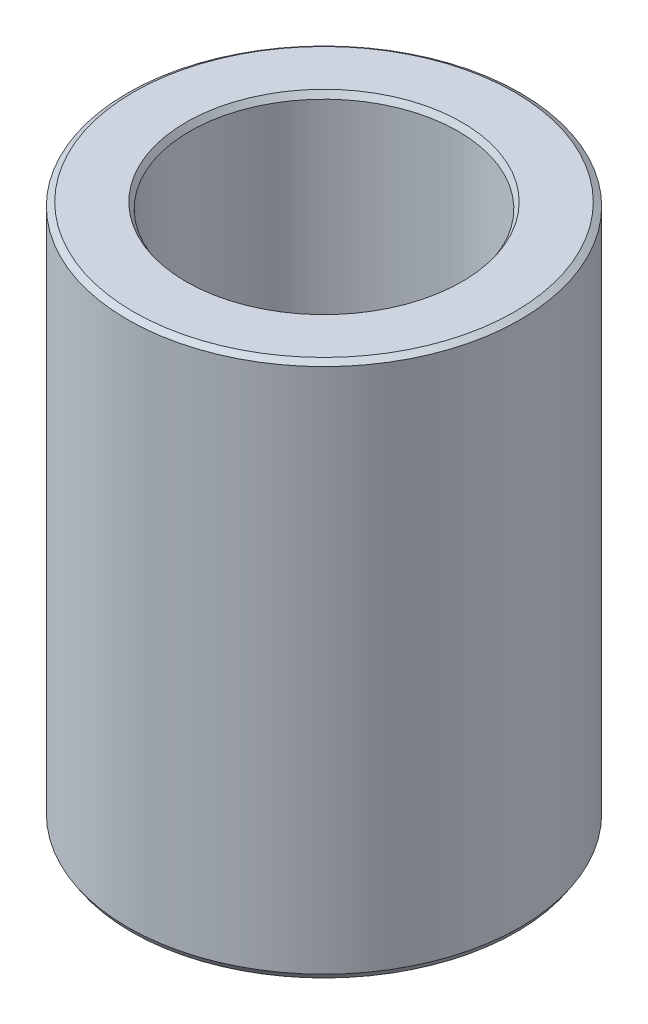
ISO-10303-21;
HEADER;
FILE_DESCRIPTION(('STEP AP214'),'2;1');
FILE_NAME('part.step','',(''),(''),'','','');
FILE_SCHEMA(('AUTOMOTIVE_DESIGN { 1 0 10303 214 1 1 1 1 }'));
ENDSEC;
DATA;
#1=APPLICATION_CONTEXT('core data for automotive mechanical design processes');
#2=APPLICATION_PROTOCOL_DEFINITION('international standard','automotive_design',2000,#1);
#3=PRODUCT_CONTEXT('',#1,'mechanical');
#4=PRODUCT('Part','Part','',(#3));
#5=PRODUCT_RELATED_PRODUCT_CATEGORY('part','',(#4));
#6=PRODUCT_DEFINITION_FORMATION('','',#4);
#7=PRODUCT_DEFINITION_CONTEXT('part definition',#1,'design');
#8=PRODUCT_DEFINITION('design','',#6,#7);
#9=PRODUCT_DEFINITION_SHAPE('','',#8);
#10=(LENGTH_UNIT() NAMED_UNIT(*) SI_UNIT(.MILLI.,.METRE.));
#11=(NAMED_UNIT(*) PLANE_ANGLE_UNIT() SI_UNIT($,.RADIAN.));
#12=(NAMED_UNIT(*) SI_UNIT($,.STERADIAN.) SOLID_ANGLE_UNIT());
#13=UNCERTAINTY_MEASURE_WITH_UNIT(LENGTH_MEASURE(1.E-05),#10,'distance_accuracy_value','');
#14=(GEOMETRIC_REPRESENTATION_CONTEXT(3) GLOBAL_UNCERTAINTY_ASSIGNED_CONTEXT((#13)) GLOBAL_UNIT_ASSIGNED_CONTEXT((#10,
#11,#12)) REPRESENTATION_CONTEXT('',''));
#15=CARTESIAN_POINT('',(0.,0.,0.));
#16=DIRECTION('',(0.,0.,1.));
#17=DIRECTION('',(1.,0.,0.));
#18=AXIS2_PLACEMENT_3D('',#15,#16,#17);
#19=CARTESIAN_POINT('',(0.,61.4130107186941,0.));
#20=DIRECTION('',(0.,-1.,0.));
#21=DIRECTION('',(0.,0.,-1.));
#22=AXIS2_PLACEMENT_3D('',#19,#20,#21);
#23=CYLINDRICAL_SURFACE('',#22,22.5);
#24=CARTESIAN_POINT('',(0.,0.6778723919579,0.));
#25=DIRECTION('',(0.,1.,0.));
#26=DIRECTION('',(0.,0.,1.));
#27=AXIS2_PLACEMENT_3D('',#24,#25,#26);
#28=CIRCLE('',#27,22.5);
#29=CARTESIAN_POINT('',(0.,0.6778723919579,-22.5));
#30=VERTEX_POINT('',#29);
#31=EDGE_CURVE('E10',#30,#30,#28,.T.);
#32=CARTESIAN_POINT('',(0.,60.981662881879,0.));
#33=DIRECTION('',(0.,1.,0.));
#34=DIRECTION('',(0.,0.,1.));
#35=AXIS2_PLACEMENT_3D('',#32,#33,#34);
#36=CIRCLE('',#35,22.5);
#37=CARTESIAN_POINT('',(0.,60.981662881879,-22.5));
#38=VERTEX_POINT('',#37);
#39=EDGE_CURVE('E50',#38,#38,#36,.F.);
#40=CARTESIAN_POINT('',(0.,0.6778723919579,-22.5));
#41=CARTESIAN_POINT('',(0.,1.30603687622791,-22.5));
#42=CARTESIAN_POINT('',(0.,1.93420136049792,-22.5));
#43=CARTESIAN_POINT('',(0.,3.19053032903794,-22.5));
#44=CARTESIAN_POINT('',(0.,3.81869481330796,-22.5));
#45=CARTESIAN_POINT('',(0.,5.07502378184798,-22.5));
#46=CARTESIAN_POINT('',(0.,5.70318826611799,-22.5));
#47=CARTESIAN_POINT('',(0.,6.95951723465802,-22.5));
#48=CARTESIAN_POINT('',(0.,7.58768171892803,-22.5));
#49=CARTESIAN_POINT('',(0.,8.84401068746805,-22.5));
#50=CARTESIAN_POINT('',(0.,9.47217517173806,-22.5));
#51=CARTESIAN_POINT('',(0.,10.7285041402781,-22.5));
#52=CARTESIAN_POINT('',(0.,11.3566686245481,-22.5));
#53=CARTESIAN_POINT('',(0.,12.6129975930881,-22.5));
#54=CARTESIAN_POINT('',(0.,13.2411620773581,-22.5));
#55=CARTESIAN_POINT('',(0.,14.4974910458982,-22.5));
#56=CARTESIAN_POINT('',(0.,15.1256555301682,-22.5));
#57=CARTESIAN_POINT('',(0.,16.3819844987082,-22.5));
#58=CARTESIAN_POINT('',(0.,17.0101489829782,-22.5));
#59=CARTESIAN_POINT('',(0.,18.2664779515182,-22.5));
#60=CARTESIAN_POINT('',(0.,18.8946424357882,-22.5));
#61=CARTESIAN_POINT('',(0.,20.1509714043283,-22.5));
#62=CARTESIAN_POINT('',(0.,20.7791358885983,-22.5));
#63=CARTESIAN_POINT('',(0.,22.0354648571383,-22.5));
#64=CARTESIAN_POINT('',(0.,22.6636293414083,-22.5));
#65=CARTESIAN_POINT('',(0.,23.9199583099483,-22.5));
#66=CARTESIAN_POINT('',(0.,24.5481227942183,-22.5));
#67=CARTESIAN_POINT('',(0.,25.8044517627584,-22.5));
#68=CARTESIAN_POINT('',(0.,26.4326162470284,-22.5));
#69=CARTESIAN_POINT('',(0.,27.6889452155684,-22.5));
#70=CARTESIAN_POINT('',(0.,28.3171096998384,-22.5));
#71=CARTESIAN_POINT('',(0.,29.5734386683784,-22.5));
#72=CARTESIAN_POINT('',(0.,30.2016031526484,-22.5));
#73=CARTESIAN_POINT('',(0.,31.4579321211885,-22.5));
#74=CARTESIAN_POINT('',(0.,32.0860966054585,-22.5));
#75=CARTESIAN_POINT('',(0.,33.3424255739985,-22.5));
#76=CARTESIAN_POINT('',(0.,33.9705900582685,-22.5));
#77=CARTESIAN_POINT('',(0.,35.2269190268085,-22.5));
#78=CARTESIAN_POINT('',(0.,35.8550835110785,-22.5));
#79=CARTESIAN_POINT('',(0.,37.1114124796186,-22.5));
#80=CARTESIAN_POINT('',(0.,37.7395769638886,-22.5));
#81=CARTESIAN_POINT('',(0.,38.9959059324286,-22.5));
#82=CARTESIAN_POINT('',(0.,39.6240704166986,-22.5));
#83=CARTESIAN_POINT('',(0.,40.8803993852386,-22.5));
#84=CARTESIAN_POINT('',(0.,41.5085638695087,-22.5));
#85=CARTESIAN_POINT('',(0.,42.7648928380487,-22.5));
#86=CARTESIAN_POINT('',(0.,43.3930573223187,-22.5));
#87=CARTESIAN_POINT('',(0.,44.6493862908587,-22.5));
#88=CARTESIAN_POINT('',(0.,45.2775507751287,-22.5));
#89=CARTESIAN_POINT('',(0.,46.5338797436687,-22.5));
#90=CARTESIAN_POINT('',(0.,47.1620442279388,-22.5));
#91=CARTESIAN_POINT('',(0.,48.4183731964788,-22.5));
#92=CARTESIAN_POINT('',(0.,49.0465376807488,-22.5));
#93=CARTESIAN_POINT('',(0.,50.3028666492888,-22.5));
#94=CARTESIAN_POINT('',(0.,50.9310311335588,-22.5));
#95=CARTESIAN_POINT('',(0.,52.1873601020989,-22.5));
#96=CARTESIAN_POINT('',(0.,52.8155245863689,-22.5));
#97=CARTESIAN_POINT('',(0.,54.0718535549089,-22.5));
#98=CARTESIAN_POINT('',(0.,54.7000180391789,-22.5));
#99=CARTESIAN_POINT('',(0.,55.9563470077189,-22.5));
#100=CARTESIAN_POINT('',(0.,56.5845114919889,-22.5));
#101=CARTESIAN_POINT('',(0.,57.840840460529,-22.5));
#102=CARTESIAN_POINT('',(0.,58.469004944799,-22.5));
#103=CARTESIAN_POINT('',(0.,59.725333913339,-22.5));
#104=CARTESIAN_POINT('',(0.,60.353498397609,-22.5));
#105=CARTESIAN_POINT('',(0.,60.981662881879,-22.5));
#106=B_SPLINE_CURVE_WITH_KNOTS('',3,(#40,#41,#42,#43,#44,#45,#46,#47,#48,#49,#50,#51,#52,#53,
#54,#55,#56,#57,#58,#59,#60,#61,#62,#63,#64,#65,#66,#67,#68,#69,#70,#71,#72,#73,#74,#75,#76,#77,
#78,#79,#80,#81,#82,#83,#84,#85,#86,#87,#88,#89,#90,#91,#92,#93,#94,#95,#96,#97,#98,#99,#100,
#101,#102,#103,#104,#105),.UNSPECIFIED.,.F.,.F.,(4,2,2,2,2,2,2,2,2,2,2,2,2,2,2,2,2,2,2,2,2,2,2,
2,2,2,2,2,2,2,2,2,4),(0.,1.88449345281003,3.76898690562007,5.65348035843011,7.53797381124014,
9.42246726405017,11.3069607168602,13.1914541696702,15.0759476224803,16.9604410752903,
18.8449345281003,20.7294279809104,22.6139214337204,24.4984148865305,26.3829083393405,
28.2674017921505,30.1518952449606,32.0363886977706,33.9208821505806,35.8053756033907,
37.6898690562007,39.5743625090107,41.4588559618208,43.3433494146308,45.2278428674408,
47.1123363202509,48.9968297730609,50.8813232258709,52.765816678681,54.650310131491,
56.534803584301,58.4192970371111,60.3037904899211),.UNSPECIFIED.);
#107=EDGE_CURVE('BSEAM39',#30,#38,#106,.T.);
#108=ORIENTED_EDGE('',*,*,#31,.T.);
#109=ORIENTED_EDGE('',*,*,#39,.T.);
#110=ORIENTED_EDGE('',*,*,#107,.T.);
#111=ORIENTED_EDGE('',*,*,#107,.F.);
#112=EDGE_LOOP('',(#108,#110,#109,#111));
#113=FACE_BOUND('',#112,.T.);
#114=ADVANCED_FACE('F39',(#113),#23,.T.);
#115=CARTESIAN_POINT('',(0.,61.4130107186941,0.));
#116=DIRECTION('',(0.,1.,0.));
#117=DIRECTION('',(0.,0.,1.));
#118=AXIS2_PLACEMENT_3D('',#115,#116,#117);
#119=PLANE('',#118);
#120=CARTESIAN_POINT('',(0.,61.4130107186941,0.));
#121=DIRECTION('',(0.,1.,0.));
#122=DIRECTION('',(0.,0.,1.));
#123=AXIS2_PLACEMENT_3D('',#120,#121,#122);
#124=CIRCLE('',#123,15.8183387595568);
#125=CARTESIAN_POINT('',(0.,61.4130107186941,15.8183387595568));
#126=VERTEX_POINT('',#125);
#127=EDGE_CURVE('E58',#126,#126,#124,.F.);
#128=ORIENTED_EDGE('',*,*,#127,.T.);
#129=EDGE_LOOP('',(#128));
#130=FACE_BOUND('',#129,.T.);
#131=CARTESIAN_POINT('',(0.,61.4130107186941,0.));
#132=DIRECTION('',(0.,1.,0.));
#133=DIRECTION('',(0.,0.,1.));
#134=AXIS2_PLACEMENT_3D('',#131,#132,#133);
#135=CIRCLE('',#134,21.8221276080423);
#136=CARTESIAN_POINT('',(0.,61.4130107186941,21.8221276080423));
#137=VERTEX_POINT('',#136);
#138=EDGE_CURVE('E61',#137,#137,#135,.T.);
#139=ORIENTED_EDGE('',*,*,#138,.T.);
#140=EDGE_LOOP('',(#139));
#141=FACE_BOUND('',#140,.T.);
#142=ADVANCED_FACE('F88',(#130,#141),#119,.T.);
#143=CARTESIAN_POINT('',(0.,0.,0.));
#144=DIRECTION('',(0.,1.,0.));
#145=DIRECTION('',(0.,0.,1.));
#146=AXIS2_PLACEMENT_3D('',#143,#144,#145);
#147=PLANE('',#146);
#148=CARTESIAN_POINT('',(0.,0.,0.));
#149=DIRECTION('',(0.,1.,0.));
#150=DIRECTION('',(0.,0.,1.));
#151=AXIS2_PLACEMENT_3D('',#148,#149,#150);
#152=CIRCLE('',#151,16.0648633146993);
#153=CARTESIAN_POINT('',(0.,0.,16.0648633146993));
#154=VERTEX_POINT('',#153);
#155=EDGE_CURVE('E51',#154,#154,#152,.T.);
#156=ORIENTED_EDGE('',*,*,#155,.T.);
#157=EDGE_LOOP('',(#156));
#158=FACE_BOUND('',#157,.T.);
#159=CARTESIAN_POINT('',(0.,0.,0.));
#160=DIRECTION('',(0.,1.,0.));
#161=DIRECTION('',(0.,0.,1.));
#162=AXIS2_PLACEMENT_3D('',#159,#160,#161);
#163=CIRCLE('',#162,22.0686521631848);
#164=CARTESIAN_POINT('',(0.,0.,22.0686521631848));
#165=VERTEX_POINT('',#164);
#166=EDGE_CURVE('E54',#165,#165,#163,.F.);
#167=ORIENTED_EDGE('',*,*,#166,.T.);
#168=EDGE_LOOP('',(#167));
#169=FACE_BOUND('',#168,.T.);
#170=ADVANCED_FACE('F83',(#158,#169),#147,.F.);
#171=CARTESIAN_POINT('',(0.,61.4130107186941,0.));
#172=DIRECTION('',(0.,-1.,0.));
#173=DIRECTION('',(0.,0.,-1.));
#174=AXIS2_PLACEMENT_3D('',#171,#172,#173);
#175=CYLINDRICAL_SURFACE('',#174,15.3869909227416);
#176=CARTESIAN_POINT('',(0.,60.7351383267362,0.));
#177=DIRECTION('',(0.,1.,0.));
#178=DIRECTION('',(0.,0.,1.));
#179=AXIS2_PLACEMENT_3D('',#176,#177,#178);
#180=CIRCLE('',#179,15.3869909227416);
#181=CARTESIAN_POINT('',(0.,60.7351383267362,-15.3869909227416));
#182=VERTEX_POINT('',#181);
#183=EDGE_CURVE('E67',#182,#182,#180,.T.);
#184=CARTESIAN_POINT('',(0.,0.431347836815026,0.));
#185=DIRECTION('',(0.,1.,0.));
#186=DIRECTION('',(0.,0.,1.));
#187=AXIS2_PLACEMENT_3D('',#184,#185,#186);
#188=CIRCLE('',#187,15.3869909227416);
#189=CARTESIAN_POINT('',(0.,0.431347836815026,-15.3869909227416));
#190=VERTEX_POINT('',#189);
#191=EDGE_CURVE('E69',#190,#190,#188,.F.);
#192=CARTESIAN_POINT('',(0.,60.7351383267362,-15.3869909227416));
#193=CARTESIAN_POINT('',(0.,60.1069738424662,-15.3869909227416));
#194=CARTESIAN_POINT('',(0.,59.4788093581962,-15.3869909227416));
#195=CARTESIAN_POINT('',(0.,58.2224803896562,-15.3869909227416));
#196=CARTESIAN_POINT('',(0.,57.5943159053861,-15.3869909227416));
#197=CARTESIAN_POINT('',(0.,56.3379869368461,-15.3869909227416));
#198=CARTESIAN_POINT('',(0.,55.7098224525761,-15.3869909227416));
#199=CARTESIAN_POINT('',(0.,54.4534934840361,-15.3869909227416));
#200=CARTESIAN_POINT('',(0.,53.8253289997661,-15.3869909227416));
#201=CARTESIAN_POINT('',(0.,52.5690000312261,-15.3869909227416));
#202=CARTESIAN_POINT('',(0.,51.940835546956,-15.3869909227416));
#203=CARTESIAN_POINT('',(0.,50.684506578416,-15.3869909227416));
#204=CARTESIAN_POINT('',(0.,50.056342094146,-15.3869909227416));
#205=CARTESIAN_POINT('',(0.,48.800013125606,-15.3869909227416));
#206=CARTESIAN_POINT('',(0.,48.171848641336,-15.3869909227416));
#207=CARTESIAN_POINT('',(0.,46.9155196727959,-15.3869909227416));
#208=CARTESIAN_POINT('',(0.,46.2873551885259,-15.3869909227416));
#209=CARTESIAN_POINT('',(0.,45.0310262199859,-15.3869909227416));
#210=CARTESIAN_POINT('',(0.,44.4028617357159,-15.3869909227416));
#211=CARTESIAN_POINT('',(0.,43.1465327671759,-15.3869909227416));
#212=CARTESIAN_POINT('',(0.,42.5183682829059,-15.3869909227416));
#213=CARTESIAN_POINT('',(0.,41.2620393143658,-15.3869909227416));
#214=CARTESIAN_POINT('',(0.,40.6338748300958,-15.3869909227416));
#215=CARTESIAN_POINT('',(0.,39.3775458615558,-15.3869909227416));
#216=CARTESIAN_POINT('',(0.,38.7493813772858,-15.3869909227416));
#217=CARTESIAN_POINT('',(0.,37.4930524087458,-15.3869909227416));
#218=CARTESIAN_POINT('',(0.,36.8648879244757,-15.3869909227416));
#219=CARTESIAN_POINT('',(0.,35.6085589559357,-15.3869909227416));
#220=CARTESIAN_POINT('',(0.,34.9803944716657,-15.3869909227416));
#221=CARTESIAN_POINT('',(0.,33.7240655031257,-15.3869909227416));
#222=CARTESIAN_POINT('',(0.,33.0959010188557,-15.3869909227416));
#223=CARTESIAN_POINT('',(0.,31.8395720503156,-15.3869909227416));
#224=CARTESIAN_POINT('',(0.,31.2114075660456,-15.3869909227416));
#225=CARTESIAN_POINT('',(0.,29.9550785975056,-15.3869909227416));
#226=CARTESIAN_POINT('',(0.,29.3269141132356,-15.3869909227416));
#227=CARTESIAN_POINT('',(0.,28.0705851446956,-15.3869909227416));
#228=CARTESIAN_POINT('',(0.,27.4424206604256,-15.3869909227416));
#229=CARTESIAN_POINT('',(0.,26.1860916918855,-15.3869909227416));
#230=CARTESIAN_POINT('',(0.,25.5579272076155,-15.3869909227416));
#231=CARTESIAN_POINT('',(0.,24.3015982390755,-15.3869909227416));
#232=CARTESIAN_POINT('',(0.,23.6734337548055,-15.3869909227416));
#233=CARTESIAN_POINT('',(0.,22.4171047862655,-15.3869909227416));
#234=CARTESIAN_POINT('',(0.,21.7889403019954,-15.3869909227416));
#235=CARTESIAN_POINT('',(0.,20.5326113334554,-15.3869909227416));
#236=CARTESIAN_POINT('',(0.,19.9044468491854,-15.3869909227416));
#237=CARTESIAN_POINT('',(0.,18.6481178806454,-15.3869909227416));
#238=CARTESIAN_POINT('',(0.,18.0199533963754,-15.3869909227416));
#239=CARTESIAN_POINT('',(0.,16.7636244278353,-15.3869909227416));
#240=CARTESIAN_POINT('',(0.,16.1354599435653,-15.3869909227416));
#241=CARTESIAN_POINT('',(0.,14.8791309750253,-15.3869909227416));
#242=CARTESIAN_POINT('',(0.,14.2509664907553,-15.3869909227416));
#243=CARTESIAN_POINT('',(0.,12.9946375222153,-15.3869909227416));
#244=CARTESIAN_POINT('',(0.,12.3664730379453,-15.3869909227416));
#245=CARTESIAN_POINT('',(0.,11.1101440694052,-15.3869909227416));
#246=CARTESIAN_POINT('',(0.,10.4819795851352,-15.3869909227416));
#247=CARTESIAN_POINT('',(0.,9.2256506165952,-15.3869909227416));
#248=CARTESIAN_POINT('',(0.,8.59748613232519,-15.3869909227416));
#249=CARTESIAN_POINT('',(0.,7.34115716378516,-15.3869909227416));
#250=CARTESIAN_POINT('',(0.,6.71299267951515,-15.3869909227416));
#251=CARTESIAN_POINT('',(0.,5.45666371097513,-15.3869909227416));
#252=CARTESIAN_POINT('',(0.,4.82849922670511,-15.3869909227416));
#253=CARTESIAN_POINT('',(0.,3.57217025816509,-15.3869909227416));
#254=CARTESIAN_POINT('',(0.,2.94400577389508,-15.3869909227416));
#255=CARTESIAN_POINT('',(0.,1.68767680535505,-15.3869909227416));
#256=CARTESIAN_POINT('',(0.,1.05951232108504,-15.3869909227416));
#257=CARTESIAN_POINT('',(0.,0.431347836815026,-15.3869909227416));
#258=B_SPLINE_CURVE_WITH_KNOTS('',3,(#192,#193,#194,#195,#196,#197,#198,#199,#200,#201,#202,
#203,#204,#205,#206,#207,#208,#209,#210,#211,#212,#213,#214,#215,#216,#217,#218,#219,#220,#221,
#222,#223,#224,#225,#226,#227,#228,#229,#230,#231,#232,#233,#234,#235,#236,#237,#238,#239,#240,
#241,#242,#243,#244,#245,#246,#247,#248,#249,#250,#251,#252,#253,#254,#255,#256,#257),
.UNSPECIFIED.,.F.,.F.,(4,2,2,2,2,2,2,2,2,2,2,2,2,2,2,2,2,2,2,2,2,2,2,2,2,2,2,2,2,2,2,2,4),(0.,
1.88449345281003,3.76898690562007,5.65348035843011,7.53797381124014,9.42246726405018,
11.3069607168602,13.1914541696703,15.0759476224803,16.9604410752903,18.8449345281004,
20.7294279809104,22.6139214337204,24.4984148865305,26.3829083393405,28.2674017921506,
30.1518952449606,32.0363886977706,33.9208821505807,35.8053756033907,37.6898690562007,
39.5743625090108,41.4588559618208,43.3433494146308,45.2278428674409,47.1123363202509,
48.996829773061,50.881323225871,52.765816678681,54.6503101314911,56.5348035843011,
58.4192970371111,60.3037904899212),.UNSPECIFIED.);
#259=EDGE_CURVE('BSEAM71',#182,#190,#258,.T.);
#260=ORIENTED_EDGE('',*,*,#183,.T.);
#261=ORIENTED_EDGE('',*,*,#191,.T.);
#262=ORIENTED_EDGE('',*,*,#259,.T.);
#263=ORIENTED_EDGE('',*,*,#259,.F.);
#264=EDGE_LOOP('',(#260,#262,#261,#263));
#265=FACE_BOUND('',#264,.T.);
#266=ADVANCED_FACE('F71',(#265),#175,.F.);
#267=CARTESIAN_POINT('',(0.,60.7351383267362,0.));
#268=DIRECTION('',(0.,1.,0.));
#269=DIRECTION('',(0.,0.,1.));
#270=AXIS2_PLACEMENT_3D('',#267,#268,#269);
#271=CONICAL_SURFACE('',#270,15.3869909227416,0.566702438418526);
#272=ORIENTED_EDGE('',*,*,#127,.F.);
#273=EDGE_LOOP('',(#272));
#274=FACE_BOUND('',#273,.T.);
#275=ORIENTED_EDGE('',*,*,#183,.F.);
#276=EDGE_LOOP('',(#275));
#277=FACE_BOUND('',#276,.T.);
#278=ADVANCED_FACE('F77',(#274,#277),#271,.F.);
#279=CARTESIAN_POINT('',(0.,0.,0.));
#280=DIRECTION('',(0.,-1.,0.));
#281=DIRECTION('',(0.,0.,-1.));
#282=AXIS2_PLACEMENT_3D('',#279,#280,#281);
#283=CONICAL_SURFACE('',#282,16.0648633146993,1.00409388837637);
#284=ORIENTED_EDGE('',*,*,#191,.F.);
#285=EDGE_LOOP('',(#284));
#286=FACE_BOUND('',#285,.T.);
#287=ORIENTED_EDGE('',*,*,#155,.F.);
#288=EDGE_LOOP('',(#287));
#289=FACE_BOUND('',#288,.T.);
#290=ADVANCED_FACE('F73',(#286,#289),#283,.F.);
#291=CARTESIAN_POINT('',(0.,0.6778723919579,0.));
#292=DIRECTION('',(0.,1.,0.));
#293=DIRECTION('',(0.,0.,1.));
#294=AXIS2_PLACEMENT_3D('',#291,#292,#293);
#295=CONICAL_SURFACE('',#294,22.5,0.566702438418522);
#296=ORIENTED_EDGE('',*,*,#166,.F.);
#297=EDGE_LOOP('',(#296));
#298=FACE_BOUND('',#297,.T.);
#299=ORIENTED_EDGE('',*,*,#31,.F.);
#300=EDGE_LOOP('',(#299));
#301=FACE_BOUND('',#300,.T.);
#302=ADVANCED_FACE('F76',(#298,#301),#295,.T.);
#303=CARTESIAN_POINT('',(0.,61.4130107186941,0.));
#304=DIRECTION('',(0.,-1.,0.));
#305=DIRECTION('',(0.,0.,-1.));
#306=AXIS2_PLACEMENT_3D('',#303,#304,#305);
#307=CONICAL_SURFACE('',#306,21.8221276080423,1.00409388837635);
#308=ORIENTED_EDGE('',*,*,#39,.F.);
#309=EDGE_LOOP('',(#308));
#310=FACE_BOUND('',#309,.T.);
#311=ORIENTED_EDGE('',*,*,#138,.F.);
#312=EDGE_LOOP('',(#311));
#313=FACE_BOUND('',#312,.T.);
#314=ADVANCED_FACE('F45',(#310,#313),#307,.T.);
#315=CLOSED_SHELL('',(#114,#142,#170,#266,#278,#290,#302,#314));
#316=MANIFOLD_SOLID_BREP('B2',#315);
#317=ADVANCED_BREP_SHAPE_REPRESENTATION('',(#18,#316),#14);
#318=SHAPE_DEFINITION_REPRESENTATION(#9,#317);
ENDSEC;
END-ISO-10303-21;
